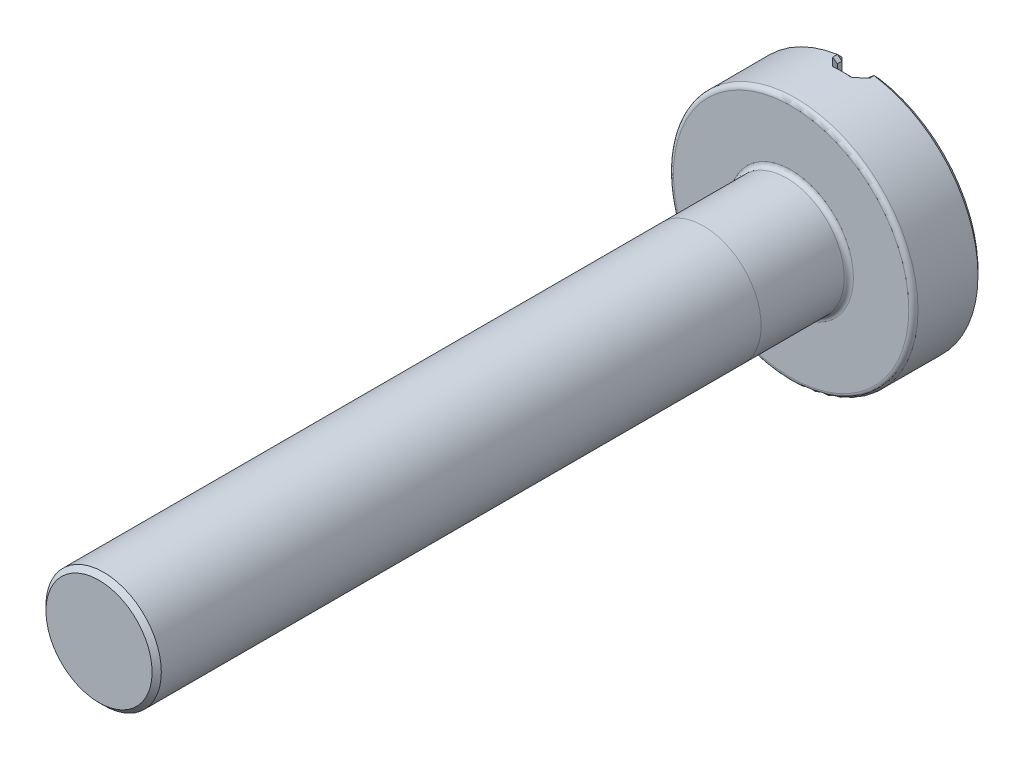
ISO-10303-21;
HEADER;
FILE_DESCRIPTION(('STEP AP214'),'2;1');
FILE_NAME('part.step','',(''),(''),'','','');
FILE_SCHEMA(('AUTOMOTIVE_DESIGN { 1 0 10303 214 1 1 1 1 }'));
ENDSEC;
DATA;
#1=APPLICATION_CONTEXT('core data for automotive mechanical design processes');
#2=APPLICATION_PROTOCOL_DEFINITION('international standard','automotive_design',2000,#1);
#3=PRODUCT_CONTEXT('',#1,'mechanical');
#4=PRODUCT('Part','Part','',(#3));
#5=PRODUCT_RELATED_PRODUCT_CATEGORY('part','',(#4));
#6=PRODUCT_DEFINITION_FORMATION('','',#4);
#7=PRODUCT_DEFINITION_CONTEXT('part definition',#1,'design');
#8=PRODUCT_DEFINITION('design','',#6,#7);
#9=PRODUCT_DEFINITION_SHAPE('','',#8);
#10=(LENGTH_UNIT() NAMED_UNIT(*) SI_UNIT(.MILLI.,.METRE.));
#11=(NAMED_UNIT(*) PLANE_ANGLE_UNIT() SI_UNIT($,.RADIAN.));
#12=(NAMED_UNIT(*) SI_UNIT($,.STERADIAN.) SOLID_ANGLE_UNIT());
#13=UNCERTAINTY_MEASURE_WITH_UNIT(LENGTH_MEASURE(1.E-05),#10,'distance_accuracy_value','');
#14=(GEOMETRIC_REPRESENTATION_CONTEXT(3) GLOBAL_UNCERTAINTY_ASSIGNED_CONTEXT((#13)) GLOBAL_UNIT_ASSIGNED_CONTEXT((#10,
#11,#12)) REPRESENTATION_CONTEXT('',''));
#15=CARTESIAN_POINT('',(0.,0.,0.));
#16=DIRECTION('',(0.,0.,1.));
#17=DIRECTION('',(1.,0.,0.));
#18=AXIS2_PLACEMENT_3D('',#15,#16,#17);
#19=CARTESIAN_POINT('',(0.,0.,7.5));
#20=DIRECTION('',(0.,0.,-1.));
#21=DIRECTION('',(-1.,0.,0.));
#22=AXIS2_PLACEMENT_3D('',#19,#20,#21);
#23=CYLINDRICAL_SURFACE('',#22,0.625);
#24=CARTESIAN_POINT('',(0.,0.,7.45));
#25=DIRECTION('',(0.,0.,1.));
#26=DIRECTION('',(1.,0.,0.));
#27=AXIS2_PLACEMENT_3D('',#24,#25,#26);
#28=CIRCLE('',#27,0.625);
#29=CARTESIAN_POINT('',(0.625,0.,7.45));
#30=VERTEX_POINT('',#29);
#31=EDGE_CURVE('E59',#30,#30,#28,.F.);
#32=ORIENTED_EDGE('',*,*,#31,.T.);
#33=EDGE_LOOP('',(#32));
#34=FACE_BOUND('',#33,.T.);
#35=CARTESIAN_POINT('',(0.,0.,0.950000000000001));
#36=DIRECTION('',(0.,0.,-1.));
#37=DIRECTION('',(0.,1.,0.));
#38=AXIS2_PLACEMENT_3D('',#35,#36,#37);
#39=CIRCLE('',#38,0.625);
#40=CARTESIAN_POINT('',(0.,0.625,0.950000000000001));
#41=VERTEX_POINT('',#40);
#42=EDGE_CURVE('E11',#41,#41,#39,.T.);
#43=ORIENTED_EDGE('',*,*,#42,.F.);
#44=EDGE_LOOP('',(#43));
#45=FACE_BOUND('',#44,.T.);
#46=ADVANCED_FACE('F49',(#34,#45),#23,.T.);
#47=CARTESIAN_POINT('',(0.,0.,-0.75));
#48=DIRECTION('',(0.,0.,1.));
#49=DIRECTION('',(1.,0.,0.));
#50=AXIS2_PLACEMENT_3D('',#47,#48,#49);
#51=PLANE('',#50);
#52=DIRECTION('',(0.,1.,0.));
#53=VECTOR('',#52,1.);
#54=CARTESIAN_POINT('',(0.199999999999999,0.,-0.75));
#55=LINE('',#54,#53);
#56=CARTESIAN_POINT('',(0.199999999999999,-1.2592160259463,-0.75));
#57=VERTEX_POINT('',#56);
#58=CARTESIAN_POINT('',(0.199999999999999,1.2592160259463,-0.75));
#59=VERTEX_POINT('',#58);
#60=EDGE_CURVE('E444',#57,#59,#55,.T.);
#61=ORIENTED_EDGE('',*,*,#60,.T.);
#62=CARTESIAN_POINT('',(0.,0.,-0.75));
#63=DIRECTION('',(0.,0.,1.));
#64=DIRECTION('',(1.,0.,0.));
#65=AXIS2_PLACEMENT_3D('',#62,#63,#64);
#66=CIRCLE('',#65,1.275);
#67=EDGE_CURVE('E440',#59,#57,#66,.F.);
#68=ORIENTED_EDGE('',*,*,#67,.T.);
#69=EDGE_LOOP('',(#61,#68));
#70=FACE_BOUND('',#69,.T.);
#71=ADVANCED_FACE('F562',(#70),#51,.F.);
#72=ORIENTED_EDGE('',*,*,#42,.T.);
#73=EDGE_LOOP('',(#72));
#74=FACE_BOUND('',#73,.T.);
#75=CARTESIAN_POINT('',(0.,0.,0.0499999999999997));
#76=DIRECTION('',(0.,0.,1.));
#77=DIRECTION('',(1.,0.,0.));
#78=AXIS2_PLACEMENT_3D('',#75,#76,#77);
#79=CIRCLE('',#78,0.625);
#80=CARTESIAN_POINT('',(0.625,0.,0.0499999999999997));
#81=VERTEX_POINT('',#80);
#82=EDGE_CURVE('E583',#81,#81,#79,.T.);
#83=ORIENTED_EDGE('',*,*,#82,.T.);
#84=EDGE_LOOP('',(#83));
#85=FACE_BOUND('',#84,.T.);
#86=ADVANCED_FACE('F234',(#74,#85),#23,.T.);
#87=CARTESIAN_POINT('',(0.,0.,7.5));
#88=DIRECTION('',(0.,0.,1.));
#89=DIRECTION('',(1.,0.,0.));
#90=AXIS2_PLACEMENT_3D('',#87,#88,#89);
#91=PLANE('',#90);
#92=CARTESIAN_POINT('',(0.,0.,7.5));
#93=DIRECTION('',(0.,0.,1.));
#94=DIRECTION('',(1.,0.,0.));
#95=AXIS2_PLACEMENT_3D('',#92,#93,#94);
#96=CIRCLE('',#95,0.574999999999999);
#97=CARTESIAN_POINT('',(0.574999999999999,0.,7.5));
#98=VERTEX_POINT('',#97);
#99=EDGE_CURVE('E585',#98,#98,#96,.T.);
#100=ORIENTED_EDGE('',*,*,#99,.T.);
#101=EDGE_LOOP('',(#100));
#102=FACE_BOUND('',#101,.T.);
#103=ADVANCED_FACE('F573',(#102),#91,.T.);
#104=CARTESIAN_POINT('',(0.,0.,-0.75));
#105=DIRECTION('',(0.,0.,1.));
#106=DIRECTION('',(1.,0.,0.));
#107=AXIS2_PLACEMENT_3D('',#104,#105,#106);
#108=CYLINDRICAL_SURFACE('',#107,1.325);
#109=CARTESIAN_POINT('',(0.,0.,-0.05));
#110=DIRECTION('',(0.,0.,1.));
#111=DIRECTION('',(1.,0.,0.));
#112=AXIS2_PLACEMENT_3D('',#109,#110,#111);
#113=CIRCLE('',#112,1.325);
#114=CARTESIAN_POINT('',(1.325,0.,-0.05));
#115=VERTEX_POINT('',#114);
#116=EDGE_CURVE('E586',#115,#115,#113,.F.);
#117=ORIENTED_EDGE('',*,*,#116,.T.);
#118=EDGE_LOOP('',(#117));
#119=FACE_BOUND('',#118,.T.);
#120=CARTESIAN_POINT('',(-0.10392156862745,-1.32091835764895,-0.549999999999999));
#121=CARTESIAN_POINT('',(-0.112175068312701,-1.32026906723452,-0.558388099653948));
#122=CARTESIAN_POINT('',(-0.120386669866703,-1.31954516349258,-0.566811479378972));
#123=CARTESIAN_POINT('',(-0.13672214047369,-1.31795271511288,-0.583729333154223));
#124=CARTESIAN_POINT('',(-0.144846009573558,-1.31708417055242,-0.592223807166453));
#125=CARTESIAN_POINT('',(-0.168344851185405,-1.31435388345324,-0.617038244754499));
#126=CARTESIAN_POINT('',(-0.183598640193571,-1.31230697318329,-0.63345292018414));
#127=CARTESIAN_POINT('',(-0.198671739339666,-1.31002081662382,-0.650000000000001));
#128=B_SPLINE_CURVE_WITH_KNOTS('',3,(#120,#121,#122,#123,#124,#125,#126,#127),.UNSPECIFIED.,.F.,
.F.,(4,2,2,4),(0.,0.0353564232872309,0.0707128276792089,0.138207440946603),.UNSPECIFIED.);
#129=CARTESIAN_POINT('',(-0.10392156862745,-1.32091835764895,-0.549999999999999));
#130=VERTEX_POINT('',#129);
#131=CARTESIAN_POINT('',(-0.198671739339666,-1.31002081662382,-0.650000000000001));
#132=VERTEX_POINT('',#131);
#133=EDGE_CURVE('E272',#130,#132,#128,.T.);
#134=ORIENTED_EDGE('',*,*,#133,.F.);
#135=CARTESIAN_POINT('',(0.,0.,-0.549999999999999));
#136=DIRECTION('',(0.,0.,-1.));
#137=DIRECTION('',(-1.,0.,0.));
#138=AXIS2_PLACEMENT_3D('',#135,#136,#137);
#139=CIRCLE('',#138,1.325);
#140=CARTESIAN_POINT('',(0.10392156862745,-1.32091835764895,-0.549999999999999));
#141=VERTEX_POINT('',#140);
#142=EDGE_CURVE('E288',#130,#141,#139,.F.);
#143=ORIENTED_EDGE('',*,*,#142,.T.);
#144=CARTESIAN_POINT('',(0.198671739339666,-1.31002081662382,-0.650000000000001));
#145=CARTESIAN_POINT('',(0.19077642043898,-1.31121823348618,-0.641332199762603));
#146=CARTESIAN_POINT('',(0.18283129172148,-1.31235009997626,-0.632700786022763));
#147=CARTESIAN_POINT('',(0.166845466760695,-1.31447805667633,-0.615510020097504));
#148=CARTESIAN_POINT('',(0.158804770492703,-1.31547414685122,-0.606950667930714));
#149=CARTESIAN_POINT('',(0.135281444284027,-1.31816746649488,-0.582155468986359));
#150=CARTESIAN_POINT('',(0.119677827015614,-1.31967900349186,-0.566013960271558));
#151=CARTESIAN_POINT('',(0.10392156862745,-1.32091835764895,-0.549999999999999));
#152=B_SPLINE_CURVE_WITH_KNOTS('',3,(#144,#145,#146,#147,#148,#149,#150,#151),.UNSPECIFIED.,.F.,
.F.,(4,2,2,4),(0.,0.0353563759670747,0.0707127610746747,0.138207389892827),.UNSPECIFIED.);
#153=CARTESIAN_POINT('',(0.198671739339666,-1.31002081662382,-0.650000000000001));
#154=VERTEX_POINT('',#153);
#155=EDGE_CURVE('E280',#154,#141,#152,.T.);
#156=ORIENTED_EDGE('',*,*,#155,.F.);
#157=DIRECTION('',(0.,0.,1.));
#158=VECTOR('',#157,1.);
#159=CARTESIAN_POINT('',(0.198671739339666,-1.31002081662382,-0.75));
#160=LINE('',#159,#158);
#161=CARTESIAN_POINT('',(0.198671739339666,-1.31002081662382,-0.7));
#162=VERTEX_POINT('',#161);
#163=EDGE_CURVE('E269',#154,#162,#160,.F.);
#164=ORIENTED_EDGE('',*,*,#163,.T.);
#165=CARTESIAN_POINT('',(0.,0.,-0.7));
#166=DIRECTION('',(0.,0.,1.));
#167=DIRECTION('',(1.,0.,0.));
#168=AXIS2_PLACEMENT_3D('',#165,#166,#167);
#169=CIRCLE('',#168,1.325);
#170=CARTESIAN_POINT('',(0.198671739339666,1.31002081662382,-0.7));
#171=VERTEX_POINT('',#170);
#172=EDGE_CURVE('E266',#162,#171,#169,.T.);
#173=ORIENTED_EDGE('',*,*,#172,.T.);
#174=DIRECTION('',(0.,0.,1.));
#175=VECTOR('',#174,1.);
#176=CARTESIAN_POINT('',(0.198671739339666,1.31002081662382,-0.75));
#177=LINE('',#176,#175);
#178=CARTESIAN_POINT('',(0.198671739339666,1.31002081662382,-0.650000000000001));
#179=VERTEX_POINT('',#178);
#180=EDGE_CURVE('E263',#171,#179,#177,.T.);
#181=ORIENTED_EDGE('',*,*,#180,.T.);
#182=CARTESIAN_POINT('',(0.10392156862745,1.32091835764895,-0.549999999999999));
#183=CARTESIAN_POINT('',(0.112175068312701,1.32026906723452,-0.558388099653948));
#184=CARTESIAN_POINT('',(0.120386669866703,1.31954516349258,-0.566811479378973));
#185=CARTESIAN_POINT('',(0.136722140473689,1.31795271511288,-0.583729333154223));
#186=CARTESIAN_POINT('',(0.144846009573558,1.31708417055242,-0.592223807166453));
#187=CARTESIAN_POINT('',(0.168344851185405,1.31435388345324,-0.617038244754499));
#188=CARTESIAN_POINT('',(0.183598640193571,1.31230697318329,-0.63345292018414));
#189=CARTESIAN_POINT('',(0.198671739339666,1.31002081662382,-0.650000000000001));
#190=B_SPLINE_CURVE_WITH_KNOTS('',3,(#182,#183,#184,#185,#186,#187,#188,#189),.UNSPECIFIED.,.F.,
.F.,(4,2,2,4),(0.,0.035356423287231,0.070712827679209,0.138207440946603),.UNSPECIFIED.);
#191=CARTESIAN_POINT('',(0.10392156862745,1.32091835764895,-0.549999999999999));
#192=VERTEX_POINT('',#191);
#193=EDGE_CURVE('E255',#192,#179,#190,.T.);
#194=ORIENTED_EDGE('',*,*,#193,.F.);
#195=CARTESIAN_POINT('',(0.,0.,-0.549999999999999));
#196=DIRECTION('',(0.,0.,-1.));
#197=DIRECTION('',(-1.,0.,0.));
#198=AXIS2_PLACEMENT_3D('',#195,#196,#197);
#199=CIRCLE('',#198,1.325);
#200=CARTESIAN_POINT('',(-0.10392156862745,1.32091835764895,-0.549999999999999));
#201=VERTEX_POINT('',#200);
#202=EDGE_CURVE('E220',#192,#201,#199,.F.);
#203=ORIENTED_EDGE('',*,*,#202,.T.);
#204=CARTESIAN_POINT('',(-0.198671739339666,1.31002081662382,-0.650000000000001));
#205=CARTESIAN_POINT('',(-0.19077642043898,1.31121823348618,-0.641332199762603));
#206=CARTESIAN_POINT('',(-0.18283129172148,1.31235009997626,-0.632700786022764));
#207=CARTESIAN_POINT('',(-0.166845466760695,1.31447805667633,-0.615510020097504));
#208=CARTESIAN_POINT('',(-0.158804770492703,1.31547414685122,-0.606950667930714));
#209=CARTESIAN_POINT('',(-0.135281444284027,1.31816746649488,-0.582155468986359));
#210=CARTESIAN_POINT('',(-0.119677827015615,1.31967900349186,-0.566013960271558));
#211=CARTESIAN_POINT('',(-0.10392156862745,1.32091835764895,-0.549999999999999));
#212=B_SPLINE_CURVE_WITH_KNOTS('',3,(#204,#205,#206,#207,#208,#209,#210,#211),.UNSPECIFIED.,.F.,
.F.,(4,2,2,4),(0.,0.0353563759670746,0.0707127610746746,0.138207389892827),.UNSPECIFIED.);
#213=CARTESIAN_POINT('',(-0.198671739339666,1.31002081662382,-0.650000000000001));
#214=VERTEX_POINT('',#213);
#215=EDGE_CURVE('E210',#214,#201,#212,.T.);
#216=ORIENTED_EDGE('',*,*,#215,.F.);
#217=DIRECTION('',(0.,0.,1.));
#218=VECTOR('',#217,1.);
#219=CARTESIAN_POINT('',(-0.198671739339666,1.31002081662382,-0.75));
#220=LINE('',#219,#218);
#221=CARTESIAN_POINT('',(-0.198671739339666,1.31002081662382,-0.699999999999998));
#222=VERTEX_POINT('',#221);
#223=EDGE_CURVE('E206',#214,#222,#220,.F.);
#224=ORIENTED_EDGE('',*,*,#223,.T.);
#225=CARTESIAN_POINT('',(0.,0.,-0.699999999999998));
#226=DIRECTION('',(0.,0.,1.));
#227=DIRECTION('',(1.,0.,0.));
#228=AXIS2_PLACEMENT_3D('',#225,#226,#227);
#229=CIRCLE('',#228,1.325);
#230=CARTESIAN_POINT('',(-0.198671739339666,-1.31002081662382,-0.699999999999998));
#231=VERTEX_POINT('',#230);
#232=EDGE_CURVE('E201',#222,#231,#229,.T.);
#233=ORIENTED_EDGE('',*,*,#232,.T.);
#234=DIRECTION('',(0.,0.,1.));
#235=VECTOR('',#234,1.);
#236=CARTESIAN_POINT('',(-0.198671739339666,-1.31002081662382,-0.75));
#237=LINE('',#236,#235);
#238=EDGE_CURVE('E171',#231,#132,#237,.T.);
#239=ORIENTED_EDGE('',*,*,#238,.T.);
#240=EDGE_LOOP('',(#134,#143,#156,#164,#173,#181,#194,#203,#216,#224,#233,#239));
#241=FACE_BOUND('',#240,.T.);
#242=ADVANCED_FACE('F222',(#119,#241),#108,.T.);
#243=CARTESIAN_POINT('',(0.,0.,-0.75));
#244=DIRECTION('',(0.,0.,1.));
#245=DIRECTION('',(1.,0.,0.));
#246=AXIS2_PLACEMENT_3D('',#243,#244,#245);
#247=CIRCLE('',#246,1.275);
#248=CARTESIAN_POINT('',(-0.200000000000001,-1.2592160259463,-0.75));
#249=VERTEX_POINT('',#248);
#250=CARTESIAN_POINT('',(-0.200000000000001,1.2592160259463,-0.75));
#251=VERTEX_POINT('',#250);
#252=EDGE_CURVE('E65',#249,#251,#247,.F.);
#253=ORIENTED_EDGE('',*,*,#252,.T.);
#254=DIRECTION('',(0.,-1.,0.));
#255=VECTOR('',#254,1.);
#256=CARTESIAN_POINT('',(-0.200000000000001,0.,-0.75));
#257=LINE('',#256,#255);
#258=EDGE_CURVE('E421',#251,#249,#257,.T.);
#259=ORIENTED_EDGE('',*,*,#258,.T.);
#260=EDGE_LOOP('',(#253,#259));
#261=FACE_BOUND('',#260,.T.);
#262=ADVANCED_FACE('F569',(#261),#51,.F.);
#263=CARTESIAN_POINT('',(0.,0.,0.));
#264=DIRECTION('',(0.,0.,1.));
#265=DIRECTION('',(1.,0.,0.));
#266=AXIS2_PLACEMENT_3D('',#263,#264,#265);
#267=PLANE('',#266);
#268=CARTESIAN_POINT('',(0.,0.,0.));
#269=DIRECTION('',(0.,0.,1.));
#270=DIRECTION('',(1.,0.,0.));
#271=AXIS2_PLACEMENT_3D('',#268,#269,#270);
#272=CIRCLE('',#271,1.275);
#273=CARTESIAN_POINT('',(1.275,0.,0.));
#274=VERTEX_POINT('',#273);
#275=EDGE_CURVE('E593',#274,#274,#272,.T.);
#276=ORIENTED_EDGE('',*,*,#275,.T.);
#277=EDGE_LOOP('',(#276));
#278=FACE_BOUND('',#277,.T.);
#279=CARTESIAN_POINT('',(0.,0.,0.));
#280=DIRECTION('',(0.,0.,1.));
#281=DIRECTION('',(1.,0.,0.));
#282=AXIS2_PLACEMENT_3D('',#279,#280,#281);
#283=CIRCLE('',#282,0.675);
#284=CARTESIAN_POINT('',(0.675,0.,0.));
#285=VERTEX_POINT('',#284);
#286=EDGE_CURVE('E424',#285,#285,#283,.F.);
#287=ORIENTED_EDGE('',*,*,#286,.T.);
#288=EDGE_LOOP('',(#287));
#289=FACE_BOUND('',#288,.T.);
#290=ADVANCED_FACE('F609',(#278,#289),#267,.T.);
#291=CARTESIAN_POINT('',(0.15,-3.84100157869453,-0.6));
#292=DIRECTION('',(1.,0.,0.));
#293=DIRECTION('',(0.,1.,0.));
#294=AXIS2_PLACEMENT_3D('',#291,#292,#293);
#295=PLANE('',#294);
#296=DIRECTION('',(0.,-1.,0.));
#297=VECTOR('',#296,1.);
#298=CARTESIAN_POINT('',(0.15,-3.84100157869453,-0.7));
#299=LINE('',#298,#297);
#300=CARTESIAN_POINT('',(0.15,1.27130591361667,-0.7));
#301=VERTEX_POINT('',#300);
#302=CARTESIAN_POINT('',(0.15,-1.27130591361667,-0.7));
#303=VERTEX_POINT('',#302);
#304=EDGE_CURVE('E451',#301,#303,#299,.T.);
#305=ORIENTED_EDGE('',*,*,#304,.T.);
#306=DIRECTION('',(0.,0.,1.));
#307=VECTOR('',#306,1.);
#308=CARTESIAN_POINT('',(0.15,-1.27130591361667,-0.6));
#309=LINE('',#308,#307);
#310=CARTESIAN_POINT('',(0.15,-1.27130591361667,-0.650000000000001));
#311=VERTEX_POINT('',#310);
#312=EDGE_CURVE('E447',#303,#311,#309,.T.);
#313=ORIENTED_EDGE('',*,*,#312,.T.);
#314=DIRECTION('',(0.,1.,0.));
#315=VECTOR('',#314,1.);
#316=CARTESIAN_POINT('',(0.15,-3.84100157869453,-0.650000000000001));
#317=LINE('',#316,#315);
#318=CARTESIAN_POINT('',(0.15,1.27130591361667,-0.650000000000001));
#319=VERTEX_POINT('',#318);
#320=EDGE_CURVE('E456',#311,#319,#317,.T.);
#321=ORIENTED_EDGE('',*,*,#320,.T.);
#322=DIRECTION('',(0.,0.,-1.));
#323=VECTOR('',#322,1.);
#324=CARTESIAN_POINT('',(0.15,1.27130591361667,-0.75));
#325=LINE('',#324,#323);
#326=EDGE_CURVE('E454',#319,#301,#325,.T.);
#327=ORIENTED_EDGE('',*,*,#326,.T.);
#328=EDGE_LOOP('',(#305,#313,#321,#327));
#329=FACE_BOUND('',#328,.T.);
#330=ADVANCED_FACE('F611',(#329),#295,.F.);
#331=CARTESIAN_POINT('',(-0.15,-3.84100157869453,-0.6));
#332=DIRECTION('',(-1.,0.,0.));
#333=DIRECTION('',(0.,0.,1.));
#334=AXIS2_PLACEMENT_3D('',#331,#332,#333);
#335=PLANE('',#334);
#336=DIRECTION('',(0.,0.,1.));
#337=VECTOR('',#336,1.);
#338=CARTESIAN_POINT('',(-0.15,1.27130591361667,-0.6));
#339=LINE('',#338,#337);
#340=CARTESIAN_POINT('',(-0.15,1.27130591361667,-0.699999999999998));
#341=VERTEX_POINT('',#340);
#342=CARTESIAN_POINT('',(-0.15,1.27130591361667,-0.650000000000001));
#343=VERTEX_POINT('',#342);
#344=EDGE_CURVE('E164',#341,#343,#339,.T.);
#345=ORIENTED_EDGE('',*,*,#344,.T.);
#346=DIRECTION('',(0.,-1.,0.));
#347=VECTOR('',#346,1.);
#348=CARTESIAN_POINT('',(-0.15,-3.84100157869453,-0.650000000000001));
#349=LINE('',#348,#347);
#350=CARTESIAN_POINT('',(-0.15,-1.27130591361667,-0.650000000000001));
#351=VERTEX_POINT('',#350);
#352=EDGE_CURVE('E159',#343,#351,#349,.T.);
#353=ORIENTED_EDGE('',*,*,#352,.T.);
#354=DIRECTION('',(0.,0.,-1.));
#355=VECTOR('',#354,1.);
#356=CARTESIAN_POINT('',(-0.15,-1.27130591361667,-0.75));
#357=LINE('',#356,#355);
#358=CARTESIAN_POINT('',(-0.15,-1.27130591361667,-0.699999999999998));
#359=VERTEX_POINT('',#358);
#360=EDGE_CURVE('E151',#351,#359,#357,.T.);
#361=ORIENTED_EDGE('',*,*,#360,.T.);
#362=DIRECTION('',(0.,1.,0.));
#363=VECTOR('',#362,1.);
#364=CARTESIAN_POINT('',(-0.15,-3.84100157869453,-0.699999999999998));
#365=LINE('',#364,#363);
#366=EDGE_CURVE('E156',#359,#341,#365,.T.);
#367=ORIENTED_EDGE('',*,*,#366,.T.);
#368=EDGE_LOOP('',(#345,#353,#361,#367));
#369=FACE_BOUND('',#368,.T.);
#370=ADVANCED_FACE('F154',(#369),#335,.F.);
#371=CARTESIAN_POINT('',(0.,0.,-0.6));
#372=DIRECTION('',(0.,0.,-1.));
#373=DIRECTION('',(-1.,0.,0.));
#374=AXIS2_PLACEMENT_3D('',#371,#372,#373);
#375=PLANE('',#374);
#376=DIRECTION('',(0.,-1.,0.));
#377=VECTOR('',#376,1.);
#378=CARTESIAN_POINT('',(0.0999999999999985,0.,-0.6));
#379=LINE('',#378,#377);
#380=CARTESIAN_POINT('',(0.0999999999999985,1.27107238188861,-0.6));
#381=VERTEX_POINT('',#380);
#382=CARTESIAN_POINT('',(0.0999999999999985,-1.27107238188861,-0.6));
#383=VERTEX_POINT('',#382);
#384=EDGE_CURVE('E431',#381,#383,#379,.T.);
#385=ORIENTED_EDGE('',*,*,#384,.T.);
#386=CARTESIAN_POINT('',(0.,0.,-0.6));
#387=DIRECTION('',(0.,0.,-1.));
#388=DIRECTION('',(-1.,0.,0.));
#389=AXIS2_PLACEMENT_3D('',#386,#387,#388);
#390=CIRCLE('',#389,1.275);
#391=CARTESIAN_POINT('',(-0.0999999999999986,-1.27107238188861,-0.6));
#392=VERTEX_POINT('',#391);
#393=EDGE_CURVE('E427',#383,#392,#390,.T.);
#394=ORIENTED_EDGE('',*,*,#393,.T.);
#395=DIRECTION('',(0.,1.,0.));
#396=VECTOR('',#395,1.);
#397=CARTESIAN_POINT('',(-0.0999999999999986,0.,-0.6));
#398=LINE('',#397,#396);
#399=CARTESIAN_POINT('',(-0.0999999999999986,1.27107238188861,-0.6));
#400=VERTEX_POINT('',#399);
#401=EDGE_CURVE('E437',#392,#400,#398,.T.);
#402=ORIENTED_EDGE('',*,*,#401,.T.);
#403=CARTESIAN_POINT('',(0.,0.,-0.6));
#404=DIRECTION('',(0.,0.,-1.));
#405=DIRECTION('',(-1.,0.,0.));
#406=AXIS2_PLACEMENT_3D('',#403,#404,#405);
#407=CIRCLE('',#406,1.275);
#408=EDGE_CURVE('E434',#400,#381,#407,.T.);
#409=ORIENTED_EDGE('',*,*,#408,.T.);
#410=EDGE_LOOP('',(#385,#394,#402,#409));
#411=FACE_BOUND('',#410,.T.);
#412=ADVANCED_FACE('F538',(#411),#375,.T.);
#413=CARTESIAN_POINT('',(0.198671739339666,-1.31002081662382,-0.7));
#414=DIRECTION('',(-0.483318268042975,-0.607619777736206,-0.630239365225422));
#415=DIRECTION('',(0.,0.71990766897583,-0.694069843855636));
#416=AXIS2_PLACEMENT_3D('',#413,#414,#415);
#417=PLANE('',#416);
#418=CARTESIAN_POINT('',(0.199999999999999,-1.2592160259463,-0.75));
#419=CARTESIAN_POINT('',(0.199784337576912,-1.26768578074797,-0.741668841382199));
#420=CARTESIAN_POINT('',(0.199565817976842,-1.2761543907114,-0.733336595400582));
#421=CARTESIAN_POINT('',(0.199123064423381,-1.29308932093724,-0.716669928733909));
#422=CARTESIAN_POINT('',(0.198898830470006,-1.30155564119964,-0.708335508048859));
#423=CARTESIAN_POINT('',(0.198671739339666,-1.31002081662382,-0.7));
#424=B_SPLINE_CURVE_WITH_KNOTS('',3,(#418,#419,#420,#421,#422,#423),.UNSPECIFIED.,.F.,.F.,(4,2,
4),(0.,0.0356471998569197,0.0712943996103586),.UNSPECIFIED.);
#425=EDGE_CURVE('E522',#162,#57,#424,.F.);
#426=ORIENTED_EDGE('',*,*,#425,.F.);
#427=DIRECTION('',(0.782610871904544,-0.622511223334013,0.));
#428=VECTOR('',#427,1.);
#429=CARTESIAN_POINT('',(0.198671739339666,-1.31002081662382,-0.7));
#430=LINE('',#429,#428);
#431=EDGE_CURVE('E190',#303,#162,#430,.T.);
#432=ORIENTED_EDGE('',*,*,#431,.F.);
#433=DIRECTION('',(-0.696992547937926,-0.168531232233021,0.696992547937937));
#434=VECTOR('',#433,1.);
#435=CARTESIAN_POINT('',(0.169097016825516,-1.26668829785148,-0.719097016825517));
#436=LINE('',#435,#434);
#437=EDGE_CURVE('E194',#57,#303,#436,.T.);
#438=ORIENTED_EDGE('',*,*,#437,.F.);
#439=EDGE_LOOP('',(#426,#432,#438));
#440=FACE_BOUND('',#439,.T.);
#441=ADVANCED_FACE('F531',(#440),#417,.T.);
#442=CARTESIAN_POINT('',(0.15,-1.27130591361667,-0.75));
#443=DIRECTION('',(0.622511223334013,0.782610871904544,0.));
#444=DIRECTION('',(0.,0.,1.));
#445=AXIS2_PLACEMENT_3D('',#442,#443,#444);
#446=PLANE('',#445);
#447=ORIENTED_EDGE('',*,*,#431,.T.);
#448=ORIENTED_EDGE('',*,*,#163,.F.);
#449=DIRECTION('',(0.782610871904544,-0.622511223334013,0.));
#450=VECTOR('',#449,1.);
#451=CARTESIAN_POINT('',(0.15,-1.27130591361667,-0.650000000000001));
#452=LINE('',#451,#450);
#453=EDGE_CURVE('E476',#311,#154,#452,.T.);
#454=ORIENTED_EDGE('',*,*,#453,.F.);
#455=ORIENTED_EDGE('',*,*,#312,.F.);
#456=EDGE_LOOP('',(#447,#448,#454,#455));
#457=FACE_BOUND('',#456,.T.);
#458=ADVANCED_FACE('F537',(#457),#446,.F.);
#459=CARTESIAN_POINT('',(0.199999999999999,0.,-0.75));
#460=DIRECTION('',(0.707106781186553,0.,0.707106781186541));
#461=DIRECTION('',(0.,1.,0.));
#462=AXIS2_PLACEMENT_3D('',#459,#460,#461);
#463=PLANE('',#462);
#464=ORIENTED_EDGE('',*,*,#437,.T.);
#465=ORIENTED_EDGE('',*,*,#304,.F.);
#466=DIRECTION('',(0.696992547937926,-0.168531232233021,-0.696992547937937));
#467=VECTOR('',#466,1.);
#468=CARTESIAN_POINT('',(0.169097016825516,1.26668829785148,-0.719097016825517));
#469=LINE('',#468,#467);
#470=EDGE_CURVE('E485',#59,#301,#469,.F.);
#471=ORIENTED_EDGE('',*,*,#470,.F.);
#472=ORIENTED_EDGE('',*,*,#60,.F.);
#473=EDGE_LOOP('',(#464,#465,#471,#472));
#474=FACE_BOUND('',#473,.T.);
#475=ADVANCED_FACE('F515',(#474),#463,.F.);
#476=CARTESIAN_POINT('',(0.,0.,-0.7));
#477=DIRECTION('',(0.,0.,1.));
#478=DIRECTION('',(1.,0.,0.));
#479=AXIS2_PLACEMENT_3D('',#476,#477,#478);
#480=CONICAL_SURFACE('',#479,1.325,0.78539816339744);
#481=ORIENTED_EDGE('',*,*,#425,.T.);
#482=ORIENTED_EDGE('',*,*,#67,.F.);
#483=CARTESIAN_POINT('',(0.198671739339666,1.31002081662382,-0.7));
#484=CARTESIAN_POINT('',(0.198898830470006,1.30155564119964,-0.708335508048859));
#485=CARTESIAN_POINT('',(0.199123064423381,1.29308932093724,-0.716669928733909));
#486=CARTESIAN_POINT('',(0.199565817976842,1.2761543907114,-0.733336595400582));
#487=CARTESIAN_POINT('',(0.199784337576912,1.26768578074797,-0.741668841382199));
#488=CARTESIAN_POINT('',(0.199999999999999,1.2592160259463,-0.75));
#489=B_SPLINE_CURVE_WITH_KNOTS('',3,(#483,#484,#485,#486,#487,#488),.UNSPECIFIED.,.F.,.F.,(4,2,
4),(0.,0.0356471997534389,0.0712943996103586),.UNSPECIFIED.);
#490=EDGE_CURVE('E479',#171,#59,#489,.T.);
#491=ORIENTED_EDGE('',*,*,#490,.F.);
#492=ORIENTED_EDGE('',*,*,#172,.F.);
#493=EDGE_LOOP('',(#481,#482,#491,#492));
#494=FACE_BOUND('',#493,.T.);
#495=ADVANCED_FACE('F508',(#494),#480,.T.);
#496=CARTESIAN_POINT('',(0.15,-1.27130591361667,-0.650000000000001));
#497=CARTESIAN_POINT('',(0.0999999999999985,-1.27107238188861,-0.6));
#498=CARTESIAN_POINT('',(0.198671739339666,-1.31002081662382,-0.650000000000001));
#499=CARTESIAN_POINT('',(0.10392156862745,-1.32091835764895,-0.549999999999999));
#500=CARTESIAN_POINT('',(0.199870609322943,-1.31097443233081,-0.650000000000001));
#501=CARTESIAN_POINT('',(0.104018163714837,-1.322146151127,-0.548768412635811));
#502=B_SPLINE_SURFACE_WITH_KNOTS('',1,1,((#496,#497),(#498,#499),(#500,#501)),.UNSPECIFIED.,.F.,
.F.,.F.,(2,1,2),(2,2),(0.,1.,1.02463174728378),(0.,1.),.UNSPECIFIED.);
#503=DIRECTION('',(-0.05545935538718,0.704928549499911,-0.70710678118654));
#504=VECTOR('',#503,1.);
#505=CARTESIAN_POINT('',(0.10392156862745,-1.32091835764895,-0.549999999999999));
#506=LINE('',#505,#504);
#507=EDGE_CURVE('E473',#383,#141,#506,.F.);
#508=CARTESIAN_POINT('',(0.0999999999999985,-1.27107238188861,-0.6));
#509=CARTESIAN_POINT('',(0.104166666666665,-1.27109184286595,-0.604166666666667));
#510=CARTESIAN_POINT('',(0.108333333333332,-1.27111130384329,-0.608333333333333));
#511=CARTESIAN_POINT('',(0.116666666666666,-1.27115022579797,-0.616666666666667));
#512=CARTESIAN_POINT('',(0.120833333333332,-1.2711696867753,-0.620833333333334));
#513=CARTESIAN_POINT('',(0.129166666666666,-1.27120860872998,-0.629166666666667));
#514=CARTESIAN_POINT('',(0.133333333333333,-1.27122806970732,-0.633333333333334));
#515=CARTESIAN_POINT('',(0.141666666666666,-1.27126699166199,-0.641666666666667));
#516=CARTESIAN_POINT('',(0.145833333333333,-1.27128645263933,-0.645833333333334));
#517=CARTESIAN_POINT('',(0.15,-1.27130591361667,-0.650000000000001));
#518=B_SPLINE_CURVE_WITH_KNOTS('',3,(#508,#509,#510,#511,#512,#513,#514,#515,#516,#517),
.UNSPECIFIED.,.F.,.F.,(4,2,2,2,4),(0.,0.0176777659382277,0.0353555318764554,0.0530332978146831,
0.0707110637529108),.UNSPECIFIED.);
#519=EDGE_CURVE('E480',#311,#383,#518,.F.);
#520=ORIENTED_EDGE('',*,*,#453,.T.);
#521=ORIENTED_EDGE('',*,*,#155,.T.);
#522=ORIENTED_EDGE('',*,*,#507,.F.);
#523=ORIENTED_EDGE('',*,*,#519,.F.);
#524=EDGE_LOOP('',(#520,#521,#522,#523));
#525=FACE_BOUND('',#524,.T.);
#526=ADVANCED_FACE('F471',(#525),#502,.T.);
#527=CARTESIAN_POINT('',(0.198671739339666,1.31002081662382,-0.7));
#528=DIRECTION('',(-0.483318268042974,0.607619777736206,-0.630239365225422));
#529=DIRECTION('',(0.,0.71990766897583,0.694069843855636));
#530=AXIS2_PLACEMENT_3D('',#527,#528,#529);
#531=PLANE('',#530);
#532=ORIENTED_EDGE('',*,*,#490,.T.);
#533=ORIENTED_EDGE('',*,*,#470,.T.);
#534=DIRECTION('',(0.782610871904544,0.622511223334013,0.));
#535=VECTOR('',#534,1.);
#536=CARTESIAN_POINT('',(0.198671739339666,1.31002081662382,-0.7));
#537=LINE('',#536,#535);
#538=EDGE_CURVE('E174',#171,#301,#537,.F.);
#539=ORIENTED_EDGE('',*,*,#538,.F.);
#540=EDGE_LOOP('',(#532,#533,#539));
#541=FACE_BOUND('',#540,.T.);
#542=ADVANCED_FACE('F504',(#541),#531,.T.);
#543=CARTESIAN_POINT('',(-0.15,-1.27130591361667,-0.75));
#544=DIRECTION('',(0.622511223334013,-0.782610871904544,0.));
#545=DIRECTION('',(0.,0.,1.));
#546=AXIS2_PLACEMENT_3D('',#543,#544,#545);
#547=PLANE('',#546);
#548=DIRECTION('',(0.782610871904544,0.622511223334013,0.));
#549=VECTOR('',#548,1.);
#550=CARTESIAN_POINT('',(-0.198671739339666,-1.31002081662382,-0.650000000000001));
#551=LINE('',#550,#549);
#552=EDGE_CURVE('E175',#132,#351,#551,.T.);
#553=ORIENTED_EDGE('',*,*,#552,.F.);
#554=ORIENTED_EDGE('',*,*,#238,.F.);
#555=DIRECTION('',(-0.782610871904544,-0.622511223334013,0.));
#556=VECTOR('',#555,1.);
#557=CARTESIAN_POINT('',(-0.15,-1.27130591361667,-0.699999999999998));
#558=LINE('',#557,#556);
#559=EDGE_CURVE('E168',#359,#231,#558,.T.);
#560=ORIENTED_EDGE('',*,*,#559,.F.);
#561=ORIENTED_EDGE('',*,*,#360,.F.);
#562=EDGE_LOOP('',(#553,#554,#560,#561));
#563=FACE_BOUND('',#562,.T.);
#564=ADVANCED_FACE('F170',(#563),#547,.T.);
#565=CARTESIAN_POINT('',(0.,0.,-0.549999999999999));
#566=DIRECTION('',(0.,0.,1.));
#567=DIRECTION('',(1.,0.,0.));
#568=AXIS2_PLACEMENT_3D('',#565,#566,#567);
#569=CONICAL_SURFACE('',#568,1.325,0.785398163397457);
#570=ORIENTED_EDGE('',*,*,#507,.T.);
#571=ORIENTED_EDGE('',*,*,#142,.F.);
#572=DIRECTION('',(-0.05545935538718,-0.704928549499911,0.70710678118654));
#573=VECTOR('',#572,1.);
#574=CARTESIAN_POINT('',(-0.0999999999999986,-1.27107238188861,-0.6));
#575=LINE('',#574,#573);
#576=EDGE_CURVE('E959',#392,#130,#575,.T.);
#577=ORIENTED_EDGE('',*,*,#576,.F.);
#578=ORIENTED_EDGE('',*,*,#393,.F.);
#579=EDGE_LOOP('',(#570,#571,#577,#578));
#580=FACE_BOUND('',#579,.T.);
#581=ADVANCED_FACE('F477',(#580),#569,.T.);
#582=CARTESIAN_POINT('',(0.0999999999999985,0.,-0.6));
#583=DIRECTION('',(0.707106781186541,0.,0.707106781186554));
#584=DIRECTION('',(0.,-1.,0.));
#585=AXIS2_PLACEMENT_3D('',#582,#583,#584);
#586=PLANE('',#585);
#587=ORIENTED_EDGE('',*,*,#519,.T.);
#588=ORIENTED_EDGE('',*,*,#384,.F.);
#589=CARTESIAN_POINT('',(0.15,1.27130591361667,-0.650000000000001));
#590=CARTESIAN_POINT('',(0.145833333333333,1.27128645263933,-0.645833333333334));
#591=CARTESIAN_POINT('',(0.141666666666666,1.27126699166199,-0.641666666666667));
#592=CARTESIAN_POINT('',(0.131249999999999,1.27121833921865,-0.63125));
#593=CARTESIAN_POINT('',(0.124999999999999,1.27118914775264,-0.625));
#594=CARTESIAN_POINT('',(0.112499999999999,1.27113076482063,-0.6125));
#595=CARTESIAN_POINT('',(0.106249999999999,1.27110157335462,-0.60625));
#596=CARTESIAN_POINT('',(0.0999999999999985,1.27107238188861,-0.6));
#597=B_SPLINE_CURVE_WITH_KNOTS('',3,(#589,#590,#591,#592,#593,#594,#595,#596),.UNSPECIFIED.,.F.,
.F.,(4,2,2,4),(0.,0.0176777659382277,0.0441944148455692,0.0707110637529107),.UNSPECIFIED.);
#598=EDGE_CURVE('E652',#319,#381,#597,.T.);
#599=ORIENTED_EDGE('',*,*,#598,.F.);
#600=ORIENTED_EDGE('',*,*,#320,.F.);
#601=EDGE_LOOP('',(#587,#588,#599,#600));
#602=FACE_BOUND('',#601,.T.);
#603=ADVANCED_FACE('F374',(#602),#586,.F.);
#604=CARTESIAN_POINT('',(0.15,1.27130591361667,-0.75));
#605=DIRECTION('',(-0.622511223334013,0.782610871904544,0.));
#606=DIRECTION('',(0.,0.,1.));
#607=AXIS2_PLACEMENT_3D('',#604,#605,#606);
#608=PLANE('',#607);
#609=ORIENTED_EDGE('',*,*,#538,.T.);
#610=ORIENTED_EDGE('',*,*,#326,.F.);
#611=DIRECTION('',(-0.782610871904544,-0.622511223334012,0.));
#612=VECTOR('',#611,1.);
#613=CARTESIAN_POINT('',(0.198671739339666,1.31002081662382,-0.650000000000001));
#614=LINE('',#613,#612);
#615=EDGE_CURVE('E383',#179,#319,#614,.T.);
#616=ORIENTED_EDGE('',*,*,#615,.F.);
#617=ORIENTED_EDGE('',*,*,#180,.F.);
#618=EDGE_LOOP('',(#609,#610,#616,#617));
#619=FACE_BOUND('',#618,.T.);
#620=ADVANCED_FACE('F373',(#619),#608,.T.);
#621=CARTESIAN_POINT('',(-0.15,-1.27130591361667,-0.699999999999998));
#622=DIRECTION('',(0.483318268042968,-0.607619777736198,-0.630239365225435));
#623=DIRECTION('',(0.,0.719907668975841,-0.694069843855624));
#624=AXIS2_PLACEMENT_3D('',#621,#622,#623);
#625=PLANE('',#624);
#626=DIRECTION('',(-0.696992547937923,0.168531232233044,-0.696992547937935));
#627=VECTOR('',#626,1.);
#628=CARTESIAN_POINT('',(-0.15,-1.27130591361667,-0.699999999999998));
#629=LINE('',#628,#627);
#630=EDGE_CURVE('E178',#359,#249,#629,.T.);
#631=ORIENTED_EDGE('',*,*,#630,.F.);
#632=ORIENTED_EDGE('',*,*,#559,.T.);
#633=CARTESIAN_POINT('',(-0.198671739339666,-1.31002081662382,-0.699999999999998));
#634=CARTESIAN_POINT('',(-0.198898830470007,-1.30155564119964,-0.708335508048858));
#635=CARTESIAN_POINT('',(-0.199123064423382,-1.29308932093724,-0.716669928733908));
#636=CARTESIAN_POINT('',(-0.199565817976843,-1.2761543907114,-0.733336595400581));
#637=CARTESIAN_POINT('',(-0.199784337576913,-1.26768578074797,-0.741668841382198));
#638=CARTESIAN_POINT('',(-0.200000000000001,-1.2592160259463,-0.75));
#639=B_SPLINE_CURVE_WITH_KNOTS('',3,(#633,#634,#635,#636,#637,#638),.UNSPECIFIED.,.F.,.F.,(4,2,
4),(0.,0.0356471997534403,0.0712943996103615),.UNSPECIFIED.);
#640=EDGE_CURVE('E180',#249,#231,#639,.F.);
#641=ORIENTED_EDGE('',*,*,#640,.F.);
#642=EDGE_LOOP('',(#631,#632,#641));
#643=FACE_BOUND('',#642,.T.);
#644=ADVANCED_FACE('F179',(#643),#625,.T.);
#645=CARTESIAN_POINT('',(-0.0999999999999986,-1.27107238188861,-0.6));
#646=CARTESIAN_POINT('',(-0.15,-1.27130591361667,-0.650000000000001));
#647=CARTESIAN_POINT('',(-0.10392156862745,-1.32091835764895,-0.549999999999999));
#648=CARTESIAN_POINT('',(-0.198671739339666,-1.31002081662382,-0.650000000000001));
#649=CARTESIAN_POINT('',(-0.104017216873217,-1.32213411608466,-0.548780484866468));
#650=CARTESIAN_POINT('',(-0.199858857793666,-1.31096508482603,-0.650000000000001));
#651=B_SPLINE_SURFACE_WITH_KNOTS('',1,1,((#645,#646),(#647,#648),(#649,#650)),.UNSPECIFIED.,.F.,
.F.,.F.,(2,1,2),(2,2),(0.,1.,1.02439030267062),(0.,1.),.UNSPECIFIED.);
#652=CARTESIAN_POINT('',(-0.15,-1.27130591361667,-0.650000000000001));
#653=CARTESIAN_POINT('',(-0.141666666666666,-1.27126699166199,-0.641666666666667));
#654=CARTESIAN_POINT('',(-0.133333333333333,-1.27122806970732,-0.633333333333334));
#655=CARTESIAN_POINT('',(-0.116666666666666,-1.27115022579797,-0.616666666666667));
#656=CARTESIAN_POINT('',(-0.108333333333332,-1.27111130384329,-0.608333333333333));
#657=CARTESIAN_POINT('',(-0.0999999999999986,-1.27107238188861,-0.6));
#658=B_SPLINE_CURVE_WITH_KNOTS('',3,(#652,#653,#654,#655,#656,#657),.UNSPECIFIED.,.F.,.F.,(4,2,
4),(0.,0.0353555318764554,0.0707110637529107),.UNSPECIFIED.);
#659=EDGE_CURVE('E183',#392,#351,#658,.F.);
#660=ORIENTED_EDGE('',*,*,#133,.T.);
#661=ORIENTED_EDGE('',*,*,#552,.T.);
#662=ORIENTED_EDGE('',*,*,#659,.F.);
#663=ORIENTED_EDGE('',*,*,#576,.T.);
#664=EDGE_LOOP('',(#660,#661,#662,#663));
#665=FACE_BOUND('',#664,.T.);
#666=ADVANCED_FACE('F372',(#665),#651,.T.);
#667=CARTESIAN_POINT('',(0.0999999999999985,1.27107238188861,-0.6));
#668=CARTESIAN_POINT('',(0.15,1.27130591361667,-0.650000000000001));
#669=CARTESIAN_POINT('',(0.10392156862745,1.32091835764895,-0.549999999999999));
#670=CARTESIAN_POINT('',(0.198671739339666,1.31002081662382,-0.650000000000001));
#671=CARTESIAN_POINT('',(0.104017216873217,1.32213411608466,-0.548780484866468));
#672=CARTESIAN_POINT('',(0.199858857793666,1.31096508482603,-0.650000000000001));
#673=B_SPLINE_SURFACE_WITH_KNOTS('',1,1,((#667,#668),(#669,#670),(#671,#672)),.UNSPECIFIED.,.F.,
.F.,.F.,(2,1,2),(2,2),(0.,1.,1.02439030267062),(0.,1.),.UNSPECIFIED.);
#674=DIRECTION('',(0.05545935538718,0.704928549499911,0.70710678118654));
#675=VECTOR('',#674,1.);
#676=CARTESIAN_POINT('',(0.0999999999999985,1.27107238188861,-0.6));
#677=LINE('',#676,#675);
#678=EDGE_CURVE('E343',#192,#381,#677,.F.);
#679=ORIENTED_EDGE('',*,*,#615,.T.);
#680=ORIENTED_EDGE('',*,*,#598,.T.);
#681=ORIENTED_EDGE('',*,*,#678,.F.);
#682=ORIENTED_EDGE('',*,*,#193,.T.);
#683=EDGE_LOOP('',(#679,#680,#681,#682));
#684=FACE_BOUND('',#683,.T.);
#685=ADVANCED_FACE('F392',(#684),#673,.T.);
#686=CARTESIAN_POINT('',(0.,0.,-0.699999999999998));
#687=DIRECTION('',(0.,0.,1.));
#688=DIRECTION('',(1.,0.,0.));
#689=AXIS2_PLACEMENT_3D('',#686,#687,#688);
#690=CONICAL_SURFACE('',#689,1.325,0.78539816339744);
#691=ORIENTED_EDGE('',*,*,#640,.T.);
#692=ORIENTED_EDGE('',*,*,#232,.F.);
#693=CARTESIAN_POINT('',(-0.200000000000001,1.2592160259463,-0.75));
#694=CARTESIAN_POINT('',(-0.199784337576913,1.26768578074797,-0.741668841382198));
#695=CARTESIAN_POINT('',(-0.199565817976843,1.2761543907114,-0.733336595400581));
#696=CARTESIAN_POINT('',(-0.199123064423382,1.29308932093724,-0.716669928733908));
#697=CARTESIAN_POINT('',(-0.198898830470007,1.30155564119964,-0.708335508048858));
#698=CARTESIAN_POINT('',(-0.198671739339666,1.31002081662382,-0.699999999999998));
#699=B_SPLINE_CURVE_WITH_KNOTS('',3,(#693,#694,#695,#696,#697,#698),.UNSPECIFIED.,.F.,.F.,(4,2,
4),(0.,0.0356471998569212,0.0712943996103615),.UNSPECIFIED.);
#700=EDGE_CURVE('E396',#251,#222,#699,.T.);
#701=ORIENTED_EDGE('',*,*,#700,.F.);
#702=ORIENTED_EDGE('',*,*,#252,.F.);
#703=EDGE_LOOP('',(#691,#692,#701,#702));
#704=FACE_BOUND('',#703,.T.);
#705=ADVANCED_FACE('F366',(#704),#690,.T.);
#706=CARTESIAN_POINT('',(-0.200000000000001,0.,-0.75));
#707=DIRECTION('',(-0.707106781186554,0.,0.707106781186541));
#708=DIRECTION('',(0.,-1.,0.));
#709=AXIS2_PLACEMENT_3D('',#706,#707,#708);
#710=PLANE('',#709);
#711=ORIENTED_EDGE('',*,*,#630,.T.);
#712=ORIENTED_EDGE('',*,*,#258,.F.);
#713=DIRECTION('',(0.696992547937923,0.168531232233044,0.696992547937935));
#714=VECTOR('',#713,1.);
#715=CARTESIAN_POINT('',(-0.169097016825515,1.26668829785148,-0.719097016825514));
#716=LINE('',#715,#714);
#717=EDGE_CURVE('E187',#341,#251,#716,.F.);
#718=ORIENTED_EDGE('',*,*,#717,.F.);
#719=ORIENTED_EDGE('',*,*,#366,.F.);
#720=EDGE_LOOP('',(#711,#712,#718,#719));
#721=FACE_BOUND('',#720,.T.);
#722=ADVANCED_FACE('F185',(#721),#710,.F.);
#723=CARTESIAN_POINT('',(-0.0999999999999986,0.,-0.6));
#724=DIRECTION('',(-0.707106781186541,0.,0.707106781186554));
#725=DIRECTION('',(0.,1.,0.));
#726=AXIS2_PLACEMENT_3D('',#723,#724,#725);
#727=PLANE('',#726);
#728=ORIENTED_EDGE('',*,*,#659,.T.);
#729=ORIENTED_EDGE('',*,*,#352,.F.);
#730=CARTESIAN_POINT('',(-0.0999999999999986,1.27107238188861,-0.6));
#731=CARTESIAN_POINT('',(-0.108333333333332,1.27111130384329,-0.608333333333333));
#732=CARTESIAN_POINT('',(-0.116666666666666,1.27115022579797,-0.616666666666667));
#733=CARTESIAN_POINT('',(-0.133333333333333,1.27122806970732,-0.633333333333334));
#734=CARTESIAN_POINT('',(-0.141666666666666,1.27126699166199,-0.641666666666667));
#735=CARTESIAN_POINT('',(-0.15,1.27130591361667,-0.650000000000001));
#736=B_SPLINE_CURVE_WITH_KNOTS('',3,(#730,#731,#732,#733,#734,#735),.UNSPECIFIED.,.F.,.F.,(4,2,
4),(0.,0.0353555318764554,0.0707110637529107),.UNSPECIFIED.);
#737=EDGE_CURVE('E327',#400,#343,#736,.T.);
#738=ORIENTED_EDGE('',*,*,#737,.F.);
#739=ORIENTED_EDGE('',*,*,#401,.F.);
#740=EDGE_LOOP('',(#728,#729,#738,#739));
#741=FACE_BOUND('',#740,.T.);
#742=ADVANCED_FACE('F312',(#741),#727,.F.);
#743=CARTESIAN_POINT('',(0.,0.,-0.549999999999999));
#744=DIRECTION('',(0.,0.,1.));
#745=DIRECTION('',(1.,0.,0.));
#746=AXIS2_PLACEMENT_3D('',#743,#744,#745);
#747=CONICAL_SURFACE('',#746,1.325,0.785398163397457);
#748=ORIENTED_EDGE('',*,*,#678,.T.);
#749=ORIENTED_EDGE('',*,*,#408,.F.);
#750=DIRECTION('',(0.05545935538718,-0.704928549499911,-0.70710678118654));
#751=VECTOR('',#750,1.);
#752=CARTESIAN_POINT('',(-0.10392156862745,1.32091835764895,-0.549999999999999));
#753=LINE('',#752,#751);
#754=EDGE_CURVE('E407',#201,#400,#753,.T.);
#755=ORIENTED_EDGE('',*,*,#754,.F.);
#756=ORIENTED_EDGE('',*,*,#202,.F.);
#757=EDGE_LOOP('',(#748,#749,#755,#756));
#758=FACE_BOUND('',#757,.T.);
#759=ADVANCED_FACE('F319',(#758),#747,.T.);
#760=CARTESIAN_POINT('',(-0.198671739339666,1.31002081662382,-0.699999999999998));
#761=DIRECTION('',(0.483318268042968,0.607619777736198,-0.630239365225435));
#762=DIRECTION('',(0.,0.719907668975841,0.694069843855624));
#763=AXIS2_PLACEMENT_3D('',#760,#761,#762);
#764=PLANE('',#763);
#765=ORIENTED_EDGE('',*,*,#717,.T.);
#766=ORIENTED_EDGE('',*,*,#700,.T.);
#767=DIRECTION('',(-0.782610871904544,0.622511223334013,0.));
#768=VECTOR('',#767,1.);
#769=CARTESIAN_POINT('',(-0.198671739339666,1.31002081662382,-0.699999999999998));
#770=LINE('',#769,#768);
#771=EDGE_CURVE('E413',#341,#222,#770,.T.);
#772=ORIENTED_EDGE('',*,*,#771,.F.);
#773=EDGE_LOOP('',(#765,#766,#772));
#774=FACE_BOUND('',#773,.T.);
#775=ADVANCED_FACE('F393',(#774),#764,.T.);
#776=CARTESIAN_POINT('',(-0.15,1.27130591361667,-0.650000000000001));
#777=CARTESIAN_POINT('',(-0.0999999999999986,1.27107238188861,-0.6));
#778=CARTESIAN_POINT('',(-0.198671739339666,1.31002081662382,-0.650000000000001));
#779=CARTESIAN_POINT('',(-0.10392156862745,1.32091835764895,-0.549999999999999));
#780=CARTESIAN_POINT('',(-0.199870609322943,1.31097443233081,-0.650000000000001));
#781=CARTESIAN_POINT('',(-0.104018163714837,1.322146151127,-0.548768412635811));
#782=B_SPLINE_SURFACE_WITH_KNOTS('',1,1,((#776,#777),(#778,#779),(#780,#781)),.UNSPECIFIED.,.F.,
.F.,.F.,(2,1,2),(2,2),(0.,1.,1.02463174728378),(0.,1.),.UNSPECIFIED.);
#783=DIRECTION('',(-0.782610871904544,0.622511223334013,0.));
#784=VECTOR('',#783,1.);
#785=CARTESIAN_POINT('',(-0.15,1.27130591361667,-0.650000000000001));
#786=LINE('',#785,#784);
#787=EDGE_CURVE('E416',#214,#343,#786,.F.);
#788=ORIENTED_EDGE('',*,*,#754,.T.);
#789=ORIENTED_EDGE('',*,*,#737,.T.);
#790=ORIENTED_EDGE('',*,*,#787,.F.);
#791=ORIENTED_EDGE('',*,*,#215,.T.);
#792=EDGE_LOOP('',(#788,#789,#790,#791));
#793=FACE_BOUND('',#792,.T.);
#794=ADVANCED_FACE('F310',(#793),#782,.T.);
#795=CARTESIAN_POINT('',(-0.15,1.27130591361667,-0.75));
#796=DIRECTION('',(-0.622511223334013,-0.782610871904544,0.));
#797=DIRECTION('',(0.,0.,1.));
#798=AXIS2_PLACEMENT_3D('',#795,#796,#797);
#799=PLANE('',#798);
#800=ORIENTED_EDGE('',*,*,#771,.T.);
#801=ORIENTED_EDGE('',*,*,#223,.F.);
#802=ORIENTED_EDGE('',*,*,#787,.T.);
#803=ORIENTED_EDGE('',*,*,#344,.F.);
#804=EDGE_LOOP('',(#800,#801,#802,#803));
#805=FACE_BOUND('',#804,.T.);
#806=ADVANCED_FACE('F298',(#805),#799,.F.);
#807=CARTESIAN_POINT('',(0.,0.,-0.05));
#808=DIRECTION('',(0.,0.,1.));
#809=DIRECTION('',(1.,0.,0.));
#810=AXIS2_PLACEMENT_3D('',#807,#808,#809);
#811=TOROIDAL_SURFACE('',#810,1.275,0.05);
#812=ORIENTED_EDGE('',*,*,#116,.F.);
#813=EDGE_LOOP('',(#812));
#814=FACE_BOUND('',#813,.T.);
#815=ORIENTED_EDGE('',*,*,#275,.F.);
#816=EDGE_LOOP('',(#815));
#817=FACE_BOUND('',#816,.T.);
#818=ADVANCED_FACE('F309',(#814,#817),#811,.T.);
#819=CARTESIAN_POINT('',(0.,0.,0.0499999999999997));
#820=DIRECTION('',(0.,0.,1.));
#821=DIRECTION('',(1.,0.,0.));
#822=AXIS2_PLACEMENT_3D('',#819,#820,#821);
#823=TOROIDAL_SURFACE('',#822,0.675,0.05);
#824=ORIENTED_EDGE('',*,*,#286,.F.);
#825=EDGE_LOOP('',(#824));
#826=FACE_BOUND('',#825,.T.);
#827=ORIENTED_EDGE('',*,*,#82,.F.);
#828=EDGE_LOOP('',(#827));
#829=FACE_BOUND('',#828,.T.);
#830=ADVANCED_FACE('F551',(#826,#829),#823,.F.);
#831=CARTESIAN_POINT('',(0.,0.,7.5));
#832=DIRECTION('',(0.,0.,-1.));
#833=DIRECTION('',(-1.,0.,0.));
#834=AXIS2_PLACEMENT_3D('',#831,#832,#833);
#835=CONICAL_SURFACE('',#834,0.574999999999999,0.785398163397451);
#836=ORIENTED_EDGE('',*,*,#31,.F.);
#837=EDGE_LOOP('',(#836));
#838=FACE_BOUND('',#837,.T.);
#839=ORIENTED_EDGE('',*,*,#99,.F.);
#840=EDGE_LOOP('',(#839));
#841=FACE_BOUND('',#840,.T.);
#842=ADVANCED_FACE('F52',(#838,#841),#835,.T.);
#843=CLOSED_SHELL('',(#46,#71,#86,#103,#242,#262,#290,#330,#370,#412,#441,#458,#475,#495,#526,
#542,#564,#581,#603,#620,#644,#666,#685,#705,#722,#742,#759,#775,#794,#806,#818,#830,#842));
#844=MANIFOLD_SOLID_BREP('B2',#843);
#845=ADVANCED_BREP_SHAPE_REPRESENTATION('',(#18,#844),#14);
#846=SHAPE_DEFINITION_REPRESENTATION(#9,#845);
ENDSEC;
END-ISO-10303-21;
